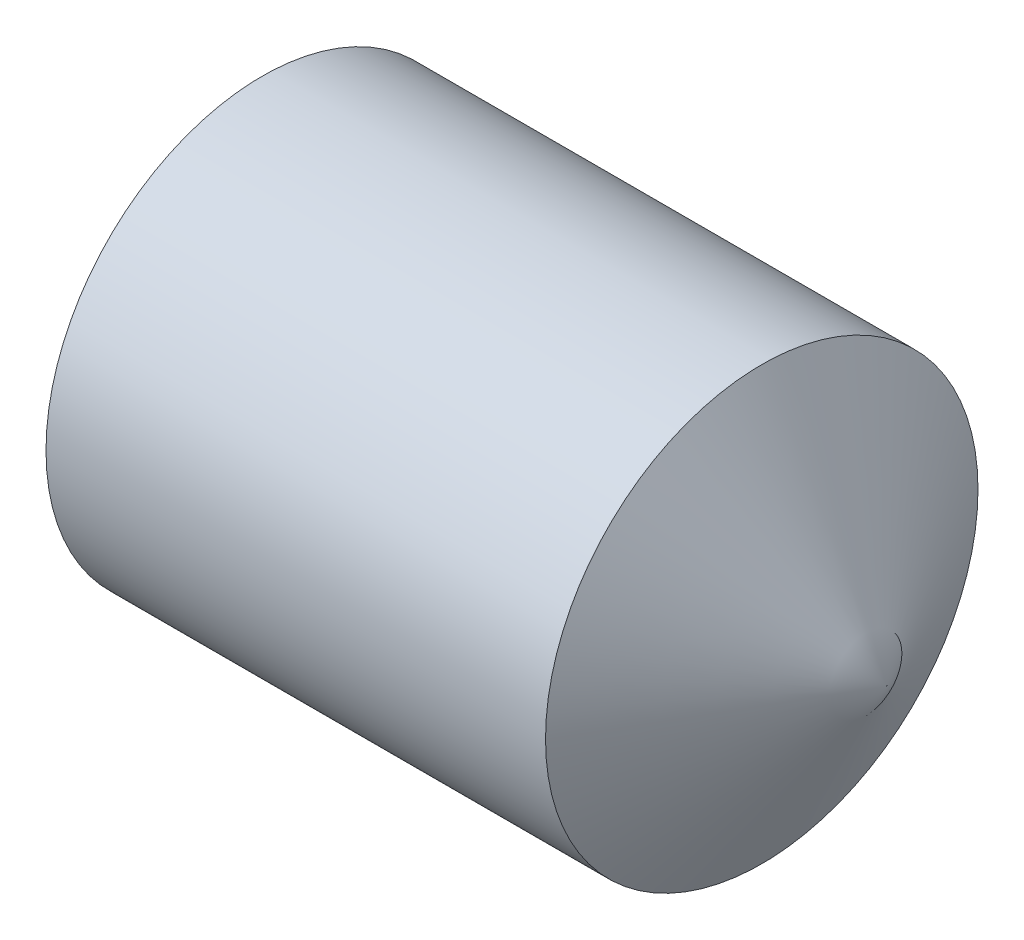
ISO-10303-21;
HEADER;
FILE_DESCRIPTION(('STEP AP214'),'2;1');
FILE_NAME('part.step','',(''),(''),'','','');
FILE_SCHEMA(('AUTOMOTIVE_DESIGN { 1 0 10303 214 1 1 1 1 }'));
ENDSEC;
DATA;
#1=APPLICATION_CONTEXT('core data for automotive mechanical design processes');
#2=APPLICATION_PROTOCOL_DEFINITION('international standard','automotive_design',2000,#1);
#3=PRODUCT_CONTEXT('',#1,'mechanical');
#4=PRODUCT('Part','Part','',(#3));
#5=PRODUCT_RELATED_PRODUCT_CATEGORY('part','',(#4));
#6=PRODUCT_DEFINITION_FORMATION('','',#4);
#7=PRODUCT_DEFINITION_CONTEXT('part definition',#1,'design');
#8=PRODUCT_DEFINITION('design','',#6,#7);
#9=PRODUCT_DEFINITION_SHAPE('','',#8);
#10=(LENGTH_UNIT() NAMED_UNIT(*) SI_UNIT(.MILLI.,.METRE.));
#11=(NAMED_UNIT(*) PLANE_ANGLE_UNIT() SI_UNIT($,.RADIAN.));
#12=(NAMED_UNIT(*) SI_UNIT($,.STERADIAN.) SOLID_ANGLE_UNIT());
#13=UNCERTAINTY_MEASURE_WITH_UNIT(LENGTH_MEASURE(1.E-05),#10,'distance_accuracy_value','');
#14=(GEOMETRIC_REPRESENTATION_CONTEXT(3) GLOBAL_UNCERTAINTY_ASSIGNED_CONTEXT((#13)) GLOBAL_UNIT_ASSIGNED_CONTEXT((#10,
#11,#12)) REPRESENTATION_CONTEXT('',''));
#15=CARTESIAN_POINT('',(0.,0.,0.));
#16=DIRECTION('',(0.,0.,1.));
#17=DIRECTION('',(1.,0.,0.));
#18=AXIS2_PLACEMENT_3D('',#15,#16,#17);
#19=CARTESIAN_POINT('',(0.,0.,0.));
#20=DIRECTION('',(-1.,0.,0.));
#21=DIRECTION('',(0.,0.,1.));
#22=AXIS2_PLACEMENT_3D('',#19,#20,#21);
#23=PLANE('',#22);
#24=CARTESIAN_POINT('',(0.,0.,0.));
#25=DIRECTION('',(-1.,0.,0.));
#26=DIRECTION('',(0.,0.,1.));
#27=AXIS2_PLACEMENT_3D('',#24,#25,#26);
#28=CIRCLE('',#27,1.61);
#29=CARTESIAN_POINT('',(0.,0.,1.61));
#30=VERTEX_POINT('',#29);
#31=EDGE_CURVE('E11',#30,#30,#28,.T.);
#32=ORIENTED_EDGE('',*,*,#31,.T.);
#33=EDGE_LOOP('',(#32));
#34=FACE_BOUND('',#33,.T.);
#35=DIRECTION('',(0.,0.,-1.));
#36=VECTOR('',#35,1.);
#37=CARTESIAN_POINT('',(0.,1.,0.577350269189623));
#38=LINE('',#37,#36);
#39=CARTESIAN_POINT('',(0.,1.,0.577350269189623));
#40=VERTEX_POINT('',#39);
#41=CARTESIAN_POINT('',(0.,1.,-0.577350269189629));
#42=VERTEX_POINT('',#41);
#43=EDGE_CURVE('E93',#40,#42,#38,.T.);
#44=ORIENTED_EDGE('',*,*,#43,.F.);
#45=DIRECTION('',(0.,-0.866025403784439,0.5));
#46=VECTOR('',#45,1.);
#47=CARTESIAN_POINT('',(0.,1.,0.577350269189623));
#48=LINE('',#47,#46);
#49=CARTESIAN_POINT('',(0.,0.,1.15470053837925));
#50=VERTEX_POINT('',#49);
#51=EDGE_CURVE('E46',#40,#50,#48,.T.);
#52=ORIENTED_EDGE('',*,*,#51,.T.);
#53=DIRECTION('',(0.,0.866025403784439,0.5));
#54=VECTOR('',#53,1.);
#55=CARTESIAN_POINT('',(0.,-0.999999999999997,0.577350269189623));
#56=LINE('',#55,#54);
#57=CARTESIAN_POINT('',(0.,-0.999999999999997,0.577350269189623));
#58=VERTEX_POINT('',#57);
#59=EDGE_CURVE('E99',#58,#50,#56,.T.);
#60=ORIENTED_EDGE('',*,*,#59,.F.);
#61=DIRECTION('',(0.,0.,-1.));
#62=VECTOR('',#61,1.);
#63=CARTESIAN_POINT('',(0.,-0.999999999999997,0.577350269189623));
#64=LINE('',#63,#62);
#65=CARTESIAN_POINT('',(0.,-0.999999999999997,-0.577350269189628));
#66=VERTEX_POINT('',#65);
#67=EDGE_CURVE('E119',#58,#66,#64,.T.);
#68=ORIENTED_EDGE('',*,*,#67,.T.);
#69=DIRECTION('',(0.,0.866025403784439,-0.5));
#70=VECTOR('',#69,1.);
#71=CARTESIAN_POINT('',(0.,-0.999999999999997,-0.577350269189628));
#72=LINE('',#71,#70);
#73=CARTESIAN_POINT('',(0.,0.,-1.15470053837925));
#74=VERTEX_POINT('',#73);
#75=EDGE_CURVE('E122',#66,#74,#72,.T.);
#76=ORIENTED_EDGE('',*,*,#75,.T.);
#77=DIRECTION('',(0.,-0.866025403784439,-0.499999999999999));
#78=VECTOR('',#77,1.);
#79=CARTESIAN_POINT('',(0.,1.,-0.577350269189629));
#80=LINE('',#79,#78);
#81=EDGE_CURVE('E125',#42,#74,#80,.T.);
#82=ORIENTED_EDGE('',*,*,#81,.F.);
#83=EDGE_LOOP('',(#44,#52,#60,#68,#76,#82));
#84=FACE_BOUND('',#83,.T.);
#85=ADVANCED_FACE('F32',(#34,#84),#23,.T.);
#86=CARTESIAN_POINT('',(0.,0.,0.));
#87=DIRECTION('',(1.,0.,0.));
#88=DIRECTION('',(0.,0.,-1.));
#89=AXIS2_PLACEMENT_3D('',#86,#87,#88);
#90=CONICAL_SURFACE('',#89,1.61,1.0471975511966);
#91=CARTESIAN_POINT('',(0.225166604983952,0.,0.));
#92=DIRECTION('',(-1.,0.,0.));
#93=DIRECTION('',(0.,0.,1.));
#94=AXIS2_PLACEMENT_3D('',#91,#92,#93);
#95=CIRCLE('',#94,2.);
#96=CARTESIAN_POINT('',(0.225166604983952,0.,2.));
#97=VERTEX_POINT('',#96);
#98=EDGE_CURVE('E39',#97,#97,#95,.T.);
#99=ORIENTED_EDGE('',*,*,#98,.T.);
#100=EDGE_LOOP('',(#99));
#101=FACE_BOUND('',#100,.T.);
#102=ORIENTED_EDGE('',*,*,#31,.F.);
#103=EDGE_LOOP('',(#102));
#104=FACE_BOUND('',#103,.T.);
#105=ADVANCED_FACE('F142',(#101,#104),#90,.T.);
#106=CARTESIAN_POINT('',(-12.7,0.,0.));
#107=DIRECTION('',(-1.,0.,0.));
#108=DIRECTION('',(0.,0.,1.));
#109=AXIS2_PLACEMENT_3D('',#106,#107,#108);
#110=CYLINDRICAL_SURFACE('',#109,2.);
#111=CARTESIAN_POINT('',(4.84529946162076,0.,0.));
#112=DIRECTION('',(-1.,0.,0.));
#113=DIRECTION('',(0.,0.,1.));
#114=AXIS2_PLACEMENT_3D('',#111,#112,#113);
#115=CIRCLE('',#114,2.);
#116=CARTESIAN_POINT('',(4.84529946162076,0.,2.));
#117=VERTEX_POINT('',#116);
#118=EDGE_CURVE('E100',#117,#117,#115,.T.);
#119=ORIENTED_EDGE('',*,*,#118,.T.);
#120=EDGE_LOOP('',(#119));
#121=FACE_BOUND('',#120,.T.);
#122=ORIENTED_EDGE('',*,*,#98,.F.);
#123=EDGE_LOOP('',(#122));
#124=FACE_BOUND('',#123,.T.);
#125=ADVANCED_FACE('F145',(#121,#124),#110,.T.);
#126=CARTESIAN_POINT('',(4.84529946162076,0.,0.));
#127=DIRECTION('',(-1.,0.,0.));
#128=DIRECTION('',(0.,0.,1.));
#129=AXIS2_PLACEMENT_3D('',#126,#127,#128);
#130=CONICAL_SURFACE('',#129,2.,1.0471975511966);
#131=CARTESIAN_POINT('',(6.,0.,0.));
#132=VERTEX_POINT('',#131);
#133=VERTEX_LOOP('',#132);
#134=FACE_BOUND('',#133,.T.);
#135=ORIENTED_EDGE('',*,*,#118,.F.);
#136=EDGE_LOOP('',(#135));
#137=FACE_BOUND('',#136,.T.);
#138=ADVANCED_FACE('F147',(#134,#137),#130,.T.);
#139=CARTESIAN_POINT('',(1.5,1.,0.577350269189623));
#140=DIRECTION('',(0.,-0.5,-0.866025403784439));
#141=DIRECTION('',(0.,0.866025403784439,-0.5));
#142=AXIS2_PLACEMENT_3D('',#139,#140,#141);
#143=PLANE('',#142);
#144=ORIENTED_EDGE('',*,*,#51,.F.);
#145=DIRECTION('',(-1.,0.,0.));
#146=VECTOR('',#145,1.);
#147=CARTESIAN_POINT('',(1.5,1.,0.577350269189623));
#148=LINE('',#147,#146);
#149=CARTESIAN_POINT('',(1.5,1.,0.577350269189623));
#150=VERTEX_POINT('',#149);
#151=EDGE_CURVE('E87',#150,#40,#148,.T.);
#152=ORIENTED_EDGE('',*,*,#151,.F.);
#153=DIRECTION('',(0.,-0.866025403784439,0.5));
#154=VECTOR('',#153,1.);
#155=CARTESIAN_POINT('',(1.5,1.,0.577350269189623));
#156=LINE('',#155,#154);
#157=CARTESIAN_POINT('',(1.5,0.,1.15470053837925));
#158=VERTEX_POINT('',#157);
#159=EDGE_CURVE('E82',#150,#158,#156,.T.);
#160=ORIENTED_EDGE('',*,*,#159,.T.);
#161=DIRECTION('',(-1.,0.,0.));
#162=VECTOR('',#161,1.);
#163=CARTESIAN_POINT('',(1.5,0.,1.15470053837925));
#164=LINE('',#163,#162);
#165=EDGE_CURVE('E85',#158,#50,#164,.T.);
#166=ORIENTED_EDGE('',*,*,#165,.T.);
#167=EDGE_LOOP('',(#144,#152,#160,#166));
#168=FACE_BOUND('',#167,.T.);
#169=ADVANCED_FACE('F84',(#168),#143,.T.);
#170=CARTESIAN_POINT('',(1.5,-0.999999999999997,0.577350269189623));
#171=DIRECTION('',(0.,-0.5,0.866025403784439));
#172=DIRECTION('',(0.,-0.866025403784439,-0.5));
#173=AXIS2_PLACEMENT_3D('',#170,#171,#172);
#174=PLANE('',#173);
#175=ORIENTED_EDGE('',*,*,#59,.T.);
#176=ORIENTED_EDGE('',*,*,#165,.F.);
#177=DIRECTION('',(0.,0.866025403784439,0.5));
#178=VECTOR('',#177,1.);
#179=CARTESIAN_POINT('',(1.5,-0.999999999999997,0.577350269189623));
#180=LINE('',#179,#178);
#181=CARTESIAN_POINT('',(1.5,-0.999999999999997,0.577350269189623));
#182=VERTEX_POINT('',#181);
#183=EDGE_CURVE('E92',#182,#158,#180,.T.);
#184=ORIENTED_EDGE('',*,*,#183,.F.);
#185=DIRECTION('',(-1.,0.,0.));
#186=VECTOR('',#185,1.);
#187=CARTESIAN_POINT('',(1.5,-0.999999999999997,0.577350269189623));
#188=LINE('',#187,#186);
#189=EDGE_CURVE('E101',#182,#58,#188,.T.);
#190=ORIENTED_EDGE('',*,*,#189,.T.);
#191=EDGE_LOOP('',(#175,#176,#184,#190));
#192=FACE_BOUND('',#191,.T.);
#193=ADVANCED_FACE('F97',(#192),#174,.F.);
#194=CARTESIAN_POINT('',(1.5,-0.999999999999997,0.577350269189623));
#195=DIRECTION('',(0.,1.,0.));
#196=DIRECTION('',(0.,0.,1.));
#197=AXIS2_PLACEMENT_3D('',#194,#195,#196);
#198=PLANE('',#197);
#199=ORIENTED_EDGE('',*,*,#67,.F.);
#200=ORIENTED_EDGE('',*,*,#189,.F.);
#201=DIRECTION('',(0.,0.,-1.));
#202=VECTOR('',#201,1.);
#203=CARTESIAN_POINT('',(1.5,-0.999999999999997,0.577350269189623));
#204=LINE('',#203,#202);
#205=CARTESIAN_POINT('',(1.5,-0.999999999999997,-0.577350269189628));
#206=VERTEX_POINT('',#205);
#207=EDGE_CURVE('E106',#182,#206,#204,.T.);
#208=ORIENTED_EDGE('',*,*,#207,.T.);
#209=DIRECTION('',(-1.,0.,0.));
#210=VECTOR('',#209,1.);
#211=CARTESIAN_POINT('',(1.5,-0.999999999999997,-0.577350269189628));
#212=LINE('',#211,#210);
#213=EDGE_CURVE('E135',#206,#66,#212,.T.);
#214=ORIENTED_EDGE('',*,*,#213,.T.);
#215=EDGE_LOOP('',(#199,#200,#208,#214));
#216=FACE_BOUND('',#215,.T.);
#217=ADVANCED_FACE('F175',(#216),#198,.T.);
#218=CARTESIAN_POINT('',(1.5,-0.999999999999997,-0.577350269189628));
#219=DIRECTION('',(0.,0.5,0.866025403784439));
#220=DIRECTION('',(0.,-0.866025403784439,0.5));
#221=AXIS2_PLACEMENT_3D('',#218,#219,#220);
#222=PLANE('',#221);
#223=ORIENTED_EDGE('',*,*,#75,.F.);
#224=ORIENTED_EDGE('',*,*,#213,.F.);
#225=DIRECTION('',(0.,0.866025403784439,-0.5));
#226=VECTOR('',#225,1.);
#227=CARTESIAN_POINT('',(1.5,-0.999999999999997,-0.577350269189628));
#228=LINE('',#227,#226);
#229=CARTESIAN_POINT('',(1.5,0.,-1.15470053837925));
#230=VERTEX_POINT('',#229);
#231=EDGE_CURVE('E108',#206,#230,#228,.T.);
#232=ORIENTED_EDGE('',*,*,#231,.T.);
#233=DIRECTION('',(-1.,0.,0.));
#234=VECTOR('',#233,1.);
#235=CARTESIAN_POINT('',(1.5,0.,-1.15470053837925));
#236=LINE('',#235,#234);
#237=EDGE_CURVE('E133',#230,#74,#236,.T.);
#238=ORIENTED_EDGE('',*,*,#237,.T.);
#239=EDGE_LOOP('',(#223,#224,#232,#238));
#240=FACE_BOUND('',#239,.T.);
#241=ADVANCED_FACE('F171',(#240),#222,.T.);
#242=CARTESIAN_POINT('',(1.5,1.,-0.577350269189629));
#243=DIRECTION('',(0.,0.5,-0.866025403784439));
#244=DIRECTION('',(0.,0.866025403784439,0.5));
#245=AXIS2_PLACEMENT_3D('',#242,#243,#244);
#246=PLANE('',#245);
#247=ORIENTED_EDGE('',*,*,#81,.T.);
#248=ORIENTED_EDGE('',*,*,#237,.F.);
#249=DIRECTION('',(0.,-0.866025403784439,-0.499999999999999));
#250=VECTOR('',#249,1.);
#251=CARTESIAN_POINT('',(1.5,1.,-0.577350269189629));
#252=LINE('',#251,#250);
#253=CARTESIAN_POINT('',(1.5,1.,-0.577350269189629));
#254=VERTEX_POINT('',#253);
#255=EDGE_CURVE('E112',#254,#230,#252,.T.);
#256=ORIENTED_EDGE('',*,*,#255,.F.);
#257=DIRECTION('',(-1.,0.,0.));
#258=VECTOR('',#257,1.);
#259=CARTESIAN_POINT('',(1.5,1.,-0.577350269189629));
#260=LINE('',#259,#258);
#261=EDGE_CURVE('E131',#254,#42,#260,.T.);
#262=ORIENTED_EDGE('',*,*,#261,.T.);
#263=EDGE_LOOP('',(#247,#248,#256,#262));
#264=FACE_BOUND('',#263,.T.);
#265=ADVANCED_FACE('F168',(#264),#246,.F.);
#266=CARTESIAN_POINT('',(1.5,1.,0.577350269189623));
#267=DIRECTION('',(0.,1.,0.));
#268=DIRECTION('',(0.,0.,1.));
#269=AXIS2_PLACEMENT_3D('',#266,#267,#268);
#270=PLANE('',#269);
#271=ORIENTED_EDGE('',*,*,#43,.T.);
#272=ORIENTED_EDGE('',*,*,#261,.F.);
#273=DIRECTION('',(0.,0.,-1.));
#274=VECTOR('',#273,1.);
#275=CARTESIAN_POINT('',(1.5,1.,0.577350269189623));
#276=LINE('',#275,#274);
#277=EDGE_CURVE('E115',#150,#254,#276,.T.);
#278=ORIENTED_EDGE('',*,*,#277,.F.);
#279=ORIENTED_EDGE('',*,*,#151,.T.);
#280=EDGE_LOOP('',(#271,#272,#278,#279));
#281=FACE_BOUND('',#280,.T.);
#282=ADVANCED_FACE('F164',(#281),#270,.F.);
#283=CARTESIAN_POINT('',(1.5,-0.999999999999997,1.73205080756887));
#284=DIRECTION('',(1.,0.,0.));
#285=DIRECTION('',(0.,0.,-1.));
#286=AXIS2_PLACEMENT_3D('',#283,#284,#285);
#287=PLANE('',#286);
#288=ORIENTED_EDGE('',*,*,#159,.F.);
#289=ORIENTED_EDGE('',*,*,#277,.T.);
#290=ORIENTED_EDGE('',*,*,#255,.T.);
#291=ORIENTED_EDGE('',*,*,#231,.F.);
#292=ORIENTED_EDGE('',*,*,#207,.F.);
#293=ORIENTED_EDGE('',*,*,#183,.T.);
#294=EDGE_LOOP('',(#288,#289,#290,#291,#292,#293));
#295=FACE_BOUND('',#294,.T.);
#296=ADVANCED_FACE('F104',(#295),#287,.F.);
#297=CLOSED_SHELL('',(#85,#105,#125,#138,#169,#193,#217,#241,#265,#282,#296));
#298=MANIFOLD_SOLID_BREP('B2',#297);
#299=ADVANCED_BREP_SHAPE_REPRESENTATION('',(#18,#298),#14);
#300=SHAPE_DEFINITION_REPRESENTATION(#9,#299);
ENDSEC;
END-ISO-10303-21;
